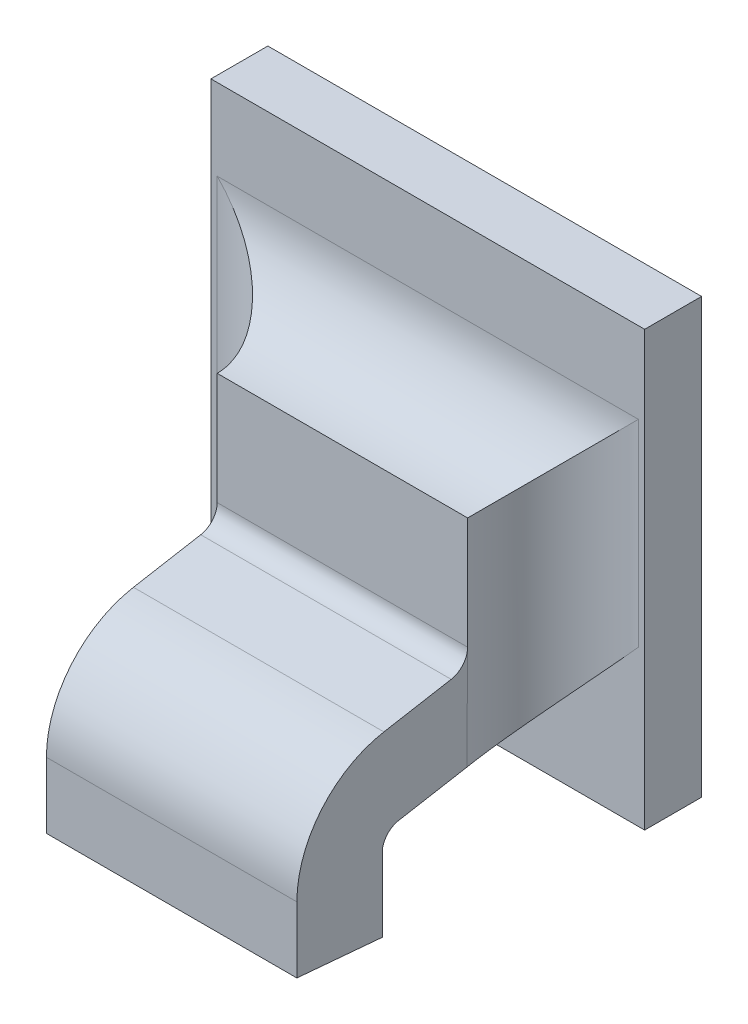
ISO-10303-21;
HEADER;
FILE_DESCRIPTION(('STEP AP214'),'2;1');
FILE_NAME('part.step','',(''),(''),'','','');
FILE_SCHEMA(('AUTOMOTIVE_DESIGN { 1 0 10303 214 1 1 1 1 }'));
ENDSEC;
DATA;
#1=APPLICATION_CONTEXT('core data for automotive mechanical design processes');
#2=APPLICATION_PROTOCOL_DEFINITION('international standard','automotive_design',2000,#1);
#3=PRODUCT_CONTEXT('',#1,'mechanical');
#4=PRODUCT('Part','Part','',(#3));
#5=PRODUCT_RELATED_PRODUCT_CATEGORY('part','',(#4));
#6=PRODUCT_DEFINITION_FORMATION('','',#4);
#7=PRODUCT_DEFINITION_CONTEXT('part definition',#1,'design');
#8=PRODUCT_DEFINITION('design','',#6,#7);
#9=PRODUCT_DEFINITION_SHAPE('','',#8);
#10=(LENGTH_UNIT() NAMED_UNIT(*) SI_UNIT(.MILLI.,.METRE.));
#11=(NAMED_UNIT(*) PLANE_ANGLE_UNIT() SI_UNIT($,.RADIAN.));
#12=(NAMED_UNIT(*) SI_UNIT($,.STERADIAN.) SOLID_ANGLE_UNIT());
#13=UNCERTAINTY_MEASURE_WITH_UNIT(LENGTH_MEASURE(1.E-05),#10,'distance_accuracy_value','');
#14=(GEOMETRIC_REPRESENTATION_CONTEXT(3) GLOBAL_UNCERTAINTY_ASSIGNED_CONTEXT((#13)) GLOBAL_UNIT_ASSIGNED_CONTEXT((#10,
#11,#12)) REPRESENTATION_CONTEXT('',''));
#15=CARTESIAN_POINT('',(0.,0.,0.));
#16=DIRECTION('',(0.,0.,1.));
#17=DIRECTION('',(1.,0.,0.));
#18=AXIS2_PLACEMENT_3D('',#15,#16,#17);
#19=CARTESIAN_POINT('',(-1.25044320945337,-0.409030625475599,0.0757120583538573));
#20=DIRECTION('',(0.,0.984807753012208,0.17364817766693));
#21=DIRECTION('',(0.,-0.17364817766693,0.984807753012208));
#22=AXIS2_PLACEMENT_3D('',#19,#20,#21);
#23=PLANE('',#22);
#24=DIRECTION('',(0.,-0.1736481776669,0.984807753012213));
#25=VECTOR('',#24,1.);
#26=CARTESIAN_POINT('',(-1.23225423307541,-0.40907165363979,0.0759447406355241));
#27=LINE('',#26,#25);
#28=CARTESIAN_POINT('',(-1.23225423307541,-0.40907165363979,0.0759447406355241));
#29=VERTEX_POINT('',#28);
#30=CARTESIAN_POINT('',(-1.23225423307541,-0.409892216923603,0.0805983862688596));
#31=VERTEX_POINT('',#30);
#32=EDGE_CURVE('E149',#29,#31,#27,.T.);
#33=ORIENTED_EDGE('',*,*,#32,.F.);
#34=DIRECTION('',(1.,0.,0.));
#35=VECTOR('',#34,1.);
#36=CARTESIAN_POINT('',(-1.23138809134313,-0.409071653639789,0.0759447406355242));
#37=LINE('',#36,#35);
#38=CARTESIAN_POINT('',(-1.24957706772108,-0.40907165363979,0.0759447406355241));
#39=VERTEX_POINT('',#38);
#40=EDGE_CURVE('E145',#29,#39,#37,.F.);
#41=ORIENTED_EDGE('',*,*,#40,.T.);
#42=DIRECTION('',(0.,-0.1736481776669,0.984807753012213));
#43=VECTOR('',#42,1.);
#44=CARTESIAN_POINT('',(-1.24957706772108,-0.40907165363979,0.0759447406355241));
#45=LINE('',#44,#43);
#46=CARTESIAN_POINT('',(-1.24957706772108,-0.409892216923603,0.0805983862688596));
#47=VERTEX_POINT('',#46);
#48=EDGE_CURVE('E187',#39,#47,#45,.T.);
#49=ORIENTED_EDGE('',*,*,#48,.T.);
#50=DIRECTION('',(1.,0.,0.));
#51=VECTOR('',#50,1.);
#52=CARTESIAN_POINT('',(-1.23138809134313,-0.409892216923603,0.0805983862688598));
#53=LINE('',#52,#51);
#54=EDGE_CURVE('E228',#31,#47,#53,.F.);
#55=ORIENTED_EDGE('',*,*,#54,.F.);
#56=EDGE_LOOP('',(#33,#41,#49,#55));
#57=FACE_BOUND('',#56,.T.);
#58=ADVANCED_FACE('F17',(#57),#23,.T.);
#59=CARTESIAN_POINT('',(-1.23138809134313,-0.417065029297904,0.0793336259197108));
#60=DIRECTION('',(1.,0.,0.));
#61=DIRECTION('',(0.,1.,0.));
#62=AXIS2_PLACEMENT_3D('',#59,#60,#61);
#63=CYLINDRICAL_SURFACE('',#62,0.00728346456692914);
#64=CARTESIAN_POINT('',(-1.23225423307541,-0.417065029297904,0.0793336259197108));
#65=DIRECTION('',(1.,0.,0.));
#66=DIRECTION('',(0.,1.,0.));
#67=AXIS2_PLACEMENT_3D('',#64,#65,#66);
#68=CIRCLE('',#67,0.00728346456692914);
#69=CARTESIAN_POINT('',(-1.23225423307541,-0.417065029297904,0.0866170904866399));
#70=VERTEX_POINT('',#69);
#71=EDGE_CURVE('E202',#31,#70,#68,.T.);
#72=ORIENTED_EDGE('',*,*,#71,.F.);
#73=ORIENTED_EDGE('',*,*,#54,.T.);
#74=CARTESIAN_POINT('',(-1.24957706772108,-0.417065029297904,0.0793336259197108));
#75=DIRECTION('',(1.,0.,0.));
#76=DIRECTION('',(0.,1.,0.));
#77=AXIS2_PLACEMENT_3D('',#74,#75,#76);
#78=CIRCLE('',#77,0.00728346456692914);
#79=CARTESIAN_POINT('',(-1.24957706772108,-0.417065029297904,0.0866170904866399));
#80=VERTEX_POINT('',#79);
#81=EDGE_CURVE('E184',#47,#80,#78,.T.);
#82=ORIENTED_EDGE('',*,*,#81,.T.);
#83=DIRECTION('',(1.,0.,0.));
#84=VECTOR('',#83,1.);
#85=CARTESIAN_POINT('',(-1.25044320945337,-0.417065029297904,0.0866170904866399));
#86=LINE('',#85,#84);
#87=EDGE_CURVE('E224',#70,#80,#86,.F.);
#88=ORIENTED_EDGE('',*,*,#87,.F.);
#89=EDGE_LOOP('',(#72,#73,#82,#88));
#90=FACE_BOUND('',#89,.T.);
#91=ADVANCED_FACE('F278',(#90),#63,.T.);
#92=CARTESIAN_POINT('',(-1.25044320945337,-0.416837019770818,0.0866170904866399));
#93=DIRECTION('',(0.,0.,1.));
#94=DIRECTION('',(0.,-1.,0.));
#95=AXIS2_PLACEMENT_3D('',#92,#93,#94);
#96=PLANE('',#95);
#97=ORIENTED_EDGE('',*,*,#87,.T.);
#98=DIRECTION('',(0.,1.,0.));
#99=VECTOR('',#98,1.);
#100=CARTESIAN_POINT('',(-1.24957706772108,-0.422863247680058,0.0866170904866399));
#101=LINE('',#100,#99);
#102=CARTESIAN_POINT('',(-1.24957706772108,-0.421625219839629,0.0866170904866399));
#103=VERTEX_POINT('',#102);
#104=EDGE_CURVE('E181',#80,#103,#101,.F.);
#105=ORIENTED_EDGE('',*,*,#104,.T.);
#106=DIRECTION('',(1.,0.,0.));
#107=VECTOR('',#106,1.);
#108=CARTESIAN_POINT('',(-1.24091565039825,-0.421625219839629,0.0866170904866399));
#109=LINE('',#108,#107);
#110=CARTESIAN_POINT('',(-1.23225423307541,-0.421625219839629,0.0866170904866399));
#111=VERTEX_POINT('',#110);
#112=EDGE_CURVE('E215',#103,#111,#109,.T.);
#113=ORIENTED_EDGE('',*,*,#112,.T.);
#114=DIRECTION('',(0.,1.,0.));
#115=VECTOR('',#114,1.);
#116=CARTESIAN_POINT('',(-1.23225423307541,-0.422863247680058,0.0866170904866399));
#117=LINE('',#116,#115);
#118=EDGE_CURVE('E200',#70,#111,#117,.F.);
#119=ORIENTED_EDGE('',*,*,#118,.F.);
#120=EDGE_LOOP('',(#97,#105,#113,#119));
#121=FACE_BOUND('',#120,.T.);
#122=ADVANCED_FACE('F282',(#121),#96,.T.);
#123=CARTESIAN_POINT('',(-1.24091565039825,-0.421657307598093,0.0862503257291207));
#124=DIRECTION('',(0.,0.99619469809174,-0.0871557427477276));
#125=DIRECTION('',(0.,0.0871557427477276,0.99619469809174));
#126=AXIS2_PLACEMENT_3D('',#123,#124,#125);
#127=PLANE('',#126);
#128=DIRECTION('',(0.,-0.0871557427476629,-0.996194698091745));
#129=VECTOR('',#128,1.);
#130=CARTESIAN_POINT('',(-1.23225423307541,-0.421625219839629,0.0866170904866399));
#131=LINE('',#130,#129);
#132=CARTESIAN_POINT('',(-1.23225423307541,-0.422141885175412,0.0807115786756163));
#133=VERTEX_POINT('',#132);
#134=EDGE_CURVE('E197',#111,#133,#131,.T.);
#135=ORIENTED_EDGE('',*,*,#134,.F.);
#136=ORIENTED_EDGE('',*,*,#112,.F.);
#137=DIRECTION('',(0.,-0.0871557427476629,-0.996194698091745));
#138=VECTOR('',#137,1.);
#139=CARTESIAN_POINT('',(-1.24957706772108,-0.421625219839629,0.0866170904866399));
#140=LINE('',#139,#138);
#141=CARTESIAN_POINT('',(-1.24957706772108,-0.422141885175412,0.0807115786756163));
#142=VERTEX_POINT('',#141);
#143=EDGE_CURVE('E178',#103,#142,#140,.T.);
#144=ORIENTED_EDGE('',*,*,#143,.T.);
#145=DIRECTION('',(1.,0.,0.));
#146=VECTOR('',#145,1.);
#147=CARTESIAN_POINT('',(-1.25044320945337,-0.422141885175412,0.0807115786756163));
#148=LINE('',#147,#146);
#149=EDGE_CURVE('E212',#142,#133,#148,.T.);
#150=ORIENTED_EDGE('',*,*,#149,.T.);
#151=EDGE_LOOP('',(#135,#136,#144,#150));
#152=FACE_BOUND('',#151,.T.);
#153=ADVANCED_FACE('F286',(#152),#127,.F.);
#154=CARTESIAN_POINT('',(-1.25044320945337,-0.416811186504029,0.0807115786756163));
#155=DIRECTION('',(0.,0.,1.));
#156=DIRECTION('',(0.,-1.,0.));
#157=AXIS2_PLACEMENT_3D('',#154,#155,#156);
#158=PLANE('',#157);
#159=ORIENTED_EDGE('',*,*,#149,.F.);
#160=DIRECTION('',(0.,1.,0.));
#161=VECTOR('',#160,1.);
#162=CARTESIAN_POINT('',(-1.24957706772108,-0.422863247680058,0.0807115786756163));
#163=LINE('',#162,#161);
#164=CARTESIAN_POINT('',(-1.24957706772108,-0.417065029297904,0.0807115786756163));
#165=VERTEX_POINT('',#164);
#166=EDGE_CURVE('E175',#142,#165,#163,.T.);
#167=ORIENTED_EDGE('',*,*,#166,.T.);
#168=DIRECTION('',(1.,0.,0.));
#169=VECTOR('',#168,1.);
#170=CARTESIAN_POINT('',(-1.23138809134313,-0.417065029297904,0.0807115786756163));
#171=LINE('',#170,#169);
#172=CARTESIAN_POINT('',(-1.23225423307541,-0.417065029297904,0.0807115786756163));
#173=VERTEX_POINT('',#172);
#174=EDGE_CURVE('E207',#165,#173,#171,.T.);
#175=ORIENTED_EDGE('',*,*,#174,.T.);
#176=DIRECTION('',(0.,1.,0.));
#177=VECTOR('',#176,1.);
#178=CARTESIAN_POINT('',(-1.23225423307541,-0.422863247680058,0.0807115786756163));
#179=LINE('',#178,#177);
#180=EDGE_CURVE('E194',#133,#173,#179,.T.);
#181=ORIENTED_EDGE('',*,*,#180,.F.);
#182=EDGE_LOOP('',(#159,#167,#175,#181));
#183=FACE_BOUND('',#182,.T.);
#184=ADVANCED_FACE('F290',(#183),#158,.F.);
#185=CARTESIAN_POINT('',(-1.23138809134313,-0.417065029297904,0.0793336259197108));
#186=DIRECTION('',(1.,0.,0.));
#187=DIRECTION('',(0.,1.,0.));
#188=AXIS2_PLACEMENT_3D('',#185,#186,#187);
#189=CYLINDRICAL_SURFACE('',#188,0.00137795275590551);
#190=DIRECTION('',(1.,0.,0.));
#191=VECTOR('',#190,1.);
#192=CARTESIAN_POINT('',(-1.25044320945337,-0.415708010740604,0.0795729049046849));
#193=LINE('',#192,#191);
#194=CARTESIAN_POINT('',(-1.24957706772108,-0.415708010740604,0.0795729049046849));
#195=VERTEX_POINT('',#194);
#196=CARTESIAN_POINT('',(-1.23225423307541,-0.415708010740604,0.0795729049046849));
#197=VERTEX_POINT('',#196);
#198=EDGE_CURVE('E191',#195,#197,#193,.T.);
#199=ORIENTED_EDGE('',*,*,#198,.T.);
#200=CARTESIAN_POINT('',(-1.23225423307541,-0.417065029297904,0.0793336259197108));
#201=DIRECTION('',(1.,0.,0.));
#202=DIRECTION('',(0.,1.,0.));
#203=AXIS2_PLACEMENT_3D('',#200,#201,#202);
#204=CIRCLE('',#203,0.00137795275590551);
#205=EDGE_CURVE('E196',#173,#197,#204,.F.);
#206=ORIENTED_EDGE('',*,*,#205,.F.);
#207=ORIENTED_EDGE('',*,*,#174,.F.);
#208=CARTESIAN_POINT('',(-1.24957706772108,-0.417065029297904,0.0793336259197108));
#209=DIRECTION('',(1.,0.,0.));
#210=DIRECTION('',(0.,1.,0.));
#211=AXIS2_PLACEMENT_3D('',#208,#209,#210);
#212=CIRCLE('',#211,0.00137795275590551);
#213=EDGE_CURVE('E172',#165,#195,#212,.F.);
#214=ORIENTED_EDGE('',*,*,#213,.T.);
#215=EDGE_LOOP('',(#199,#206,#207,#214));
#216=FACE_BOUND('',#215,.T.);
#217=ADVANCED_FACE('F294',(#216),#189,.F.);
#218=CARTESIAN_POINT('',(-1.23138809134313,-0.407714635082489,0.0761840196204982));
#219=DIRECTION('',(1.,0.,0.));
#220=DIRECTION('',(0.,1.,0.));
#221=AXIS2_PLACEMENT_3D('',#218,#219,#220);
#222=CYLINDRICAL_SURFACE('',#221,0.00137795275590552);
#223=ORIENTED_EDGE('',*,*,#40,.F.);
#224=CARTESIAN_POINT('',(-1.23225423307541,-0.407714635082489,0.0761840196204982));
#225=DIRECTION('',(1.,0.,0.));
#226=DIRECTION('',(0.,1.,0.));
#227=AXIS2_PLACEMENT_3D('',#224,#225,#226);
#228=CIRCLE('',#227,0.00137795275590552);
#229=CARTESIAN_POINT('',(-1.23225423307541,-0.407714635082489,0.0748060668645927));
#230=VERTEX_POINT('',#229);
#231=EDGE_CURVE('E20',#230,#29,#228,.F.);
#232=ORIENTED_EDGE('',*,*,#231,.F.);
#233=DIRECTION('',(1.,0.,0.));
#234=VECTOR('',#233,1.);
#235=CARTESIAN_POINT('',(-1.25044320945337,-0.407714635082489,0.0748060668645927));
#236=LINE('',#235,#234);
#237=CARTESIAN_POINT('',(-1.24957706772108,-0.407714635082489,0.0748060668645927));
#238=VERTEX_POINT('',#237);
#239=EDGE_CURVE('E127',#238,#230,#236,.T.);
#240=ORIENTED_EDGE('',*,*,#239,.F.);
#241=CARTESIAN_POINT('',(-1.24957706772108,-0.407714635082489,0.0761840196204982));
#242=DIRECTION('',(1.,0.,0.));
#243=DIRECTION('',(0.,1.,0.));
#244=AXIS2_PLACEMENT_3D('',#241,#242,#243);
#245=CIRCLE('',#244,0.00137795275590552);
#246=EDGE_CURVE('E139',#238,#39,#245,.F.);
#247=ORIENTED_EDGE('',*,*,#246,.T.);
#248=EDGE_LOOP('',(#223,#232,#240,#247));
#249=FACE_BOUND('',#248,.T.);
#250=ADVANCED_FACE('F143',(#249),#222,.F.);
#251=CARTESIAN_POINT('',(-1.23225423307541,-0.422863247680058,0.0742155156834903));
#252=DIRECTION('',(1.,0.,0.));
#253=DIRECTION('',(0.,1.,0.));
#254=AXIS2_PLACEMENT_3D('',#251,#252,#253);
#255=PLANE('',#254);
#256=ORIENTED_EDGE('',*,*,#205,.T.);
#257=DIRECTION('',(0.,-0.17364817766693,0.984807753012208));
#258=VECTOR('',#257,1.);
#259=CARTESIAN_POINT('',(-1.23225423307541,-0.4148464192926,0.0746865769896825));
#260=LINE('',#259,#258);
#261=CARTESIAN_POINT('',(-1.23225423307541,-0.414877006254794,0.074862663067971));
#262=VERTEX_POINT('',#261);
#263=EDGE_CURVE('E162',#197,#262,#260,.F.);
#264=ORIENTED_EDGE('',*,*,#263,.T.);
#265=DIRECTION('',(0.,1.,0.));
#266=VECTOR('',#265,1.);
#267=CARTESIAN_POINT('',(-1.23225423307541,-0.393026144704955,0.0748060668645927));
#268=LINE('',#267,#266);
#269=EDGE_CURVE('E138',#262,#230,#268,.T.);
#270=ORIENTED_EDGE('',*,*,#269,.T.);
#271=ORIENTED_EDGE('',*,*,#231,.T.);
#272=ORIENTED_EDGE('',*,*,#32,.T.);
#273=ORIENTED_EDGE('',*,*,#71,.T.);
#274=ORIENTED_EDGE('',*,*,#118,.T.);
#275=ORIENTED_EDGE('',*,*,#134,.T.);
#276=ORIENTED_EDGE('',*,*,#180,.T.);
#277=EDGE_LOOP('',(#256,#264,#270,#271,#272,#273,#274,#275,#276));
#278=FACE_BOUND('',#277,.T.);
#279=ADVANCED_FACE('F160',(#278),#255,.T.);
#280=CARTESIAN_POINT('',(-1.25044320945337,-0.4148464192926,0.0746865769896825));
#281=DIRECTION('',(0.,0.984807753012208,0.17364817766693));
#282=DIRECTION('',(0.,-0.17364817766693,0.984807753012208));
#283=AXIS2_PLACEMENT_3D('',#280,#281,#282);
#284=PLANE('',#283);
#285=DIRECTION('',(1.,0.,0.));
#286=VECTOR('',#285,1.);
#287=CARTESIAN_POINT('',(-1.224892028351,-0.414887447456791,0.0749192592713494));
#288=LINE('',#287,#286);
#289=CARTESIAN_POINT('',(-1.24957706772108,-0.414877006254794,0.074862663067971));
#290=VERTEX_POINT('',#289);
#291=EDGE_CURVE('E243',#262,#290,#288,.F.);
#292=ORIENTED_EDGE('',*,*,#291,.F.);
#293=ORIENTED_EDGE('',*,*,#263,.F.);
#294=ORIENTED_EDGE('',*,*,#198,.F.);
#295=DIRECTION('',(0.,0.173648177666878,-0.984807753012217));
#296=VECTOR('',#295,1.);
#297=CARTESIAN_POINT('',(-1.24957706772108,-0.415708010740604,0.0795729049046849));
#298=LINE('',#297,#296);
#299=EDGE_CURVE('E169',#195,#290,#298,.T.);
#300=ORIENTED_EDGE('',*,*,#299,.T.);
#301=EDGE_LOOP('',(#292,#293,#294,#300));
#302=FACE_BOUND('',#301,.T.);
#303=ADVANCED_FACE('F297',(#302),#284,.F.);
#304=CARTESIAN_POINT('',(-1.24957706772108,-0.422863247680058,0.0742155156834903));
#305=DIRECTION('',(1.,0.,0.));
#306=DIRECTION('',(0.,1.,0.));
#307=AXIS2_PLACEMENT_3D('',#304,#305,#306);
#308=PLANE('',#307);
#309=DIRECTION('',(0.,-1.,0.));
#310=VECTOR('',#309,1.);
#311=CARTESIAN_POINT('',(-1.24957706772109,-0.449184274957739,0.0748060668645927));
#312=LINE('',#311,#310);
#313=EDGE_CURVE('E239',#238,#290,#312,.T.);
#314=ORIENTED_EDGE('',*,*,#313,.T.);
#315=ORIENTED_EDGE('',*,*,#299,.F.);
#316=ORIENTED_EDGE('',*,*,#213,.F.);
#317=ORIENTED_EDGE('',*,*,#166,.F.);
#318=ORIENTED_EDGE('',*,*,#143,.F.);
#319=ORIENTED_EDGE('',*,*,#104,.F.);
#320=ORIENTED_EDGE('',*,*,#81,.F.);
#321=ORIENTED_EDGE('',*,*,#48,.F.);
#322=ORIENTED_EDGE('',*,*,#246,.F.);
#323=EDGE_LOOP('',(#314,#315,#316,#317,#318,#319,#320,#321,#322));
#324=FACE_BOUND('',#323,.T.);
#325=ADVANCED_FACE('F300',(#324),#308,.F.);
#326=CARTESIAN_POINT('',(-1.25044320945337,-0.399584528605045,0.0748060668645927));
#327=DIRECTION('',(0.,0.,1.));
#328=DIRECTION('',(0.,-1.,0.));
#329=AXIS2_PLACEMENT_3D('',#326,#327,#328);
#330=PLANE('',#329);
#331=DIRECTION('',(0.,1.,0.));
#332=VECTOR('',#331,1.);
#333=CARTESIAN_POINT('',(-1.23225423307541,-0.393026144704955,0.0748060668645927));
#334=LINE('',#333,#332);
#335=CARTESIAN_POINT('',(-1.23225423307541,-0.399971676532543,0.0748060668645927));
#336=VERTEX_POINT('',#335);
#337=EDGE_CURVE('E132',#230,#336,#334,.T.);
#338=ORIENTED_EDGE('',*,*,#337,.T.);
#339=DIRECTION('',(-1.,0.,0.));
#340=VECTOR('',#339,1.);
#341=CARTESIAN_POINT('',(-1.25693927244549,-0.399971676532543,0.0748060668645927));
#342=LINE('',#341,#340);
#343=CARTESIAN_POINT('',(-1.24957706772109,-0.399971676532543,0.0748060668645927));
#344=VERTEX_POINT('',#343);
#345=EDGE_CURVE('E237',#336,#344,#342,.T.);
#346=ORIENTED_EDGE('',*,*,#345,.T.);
#347=DIRECTION('',(0.,-1.,0.));
#348=VECTOR('',#347,1.);
#349=CARTESIAN_POINT('',(-1.24957706772109,-0.449184274957739,0.0748060668645927));
#350=LINE('',#349,#348);
#351=EDGE_CURVE('E134',#344,#238,#350,.T.);
#352=ORIENTED_EDGE('',*,*,#351,.T.);
#353=ORIENTED_EDGE('',*,*,#239,.T.);
#354=EDGE_LOOP('',(#338,#346,#352,#353));
#355=FACE_BOUND('',#354,.T.);
#356=ADVANCED_FACE('F129',(#355),#330,.T.);
#357=CARTESIAN_POINT('',(-1.22634872126439,-0.393026144704955,0.0748060668645927));
#358=DIRECTION('',(0.,1.,0.));
#359=DIRECTION('',(-1.,0.,0.));
#360=AXIS2_PLACEMENT_3D('',#357,#358,#359);
#361=CYLINDRICAL_SURFACE('',#360,0.00590551181102362);
#362=DIRECTION('',(0.,-1.,0.));
#363=VECTOR('',#362,1.);
#364=CARTESIAN_POINT('',(-1.22634872126439,-0.386955627617741,0.068900555053569));
#365=LINE('',#364,#363);
#366=CARTESIAN_POINT('',(-1.22634872126439,-0.394066164721519,0.068900555053569));
#367=VERTEX_POINT('',#366);
#368=CARTESIAN_POINT('',(-1.22634872126439,-0.407714635082489,0.068900555053569));
#369=VERTEX_POINT('',#368);
#370=EDGE_CURVE('E236',#367,#369,#365,.T.);
#371=ORIENTED_EDGE('',*,*,#370,.F.);
#372=CARTESIAN_POINT('',(-1.22634872126439,-0.394066164721519,0.0748060668645927));
#373=DIRECTION('',(-0.707106781186547,0.707106781186548,0.));
#374=DIRECTION('',(0.707106781186548,0.707106781186547,0.));
#375=AXIS2_PLACEMENT_3D('',#372,#373,#374);
#376=ELLIPSE('',#375,0.0083516548959041,0.00590551181102362);
#377=EDGE_CURVE('E156',#367,#336,#376,.T.);
#378=ORIENTED_EDGE('',*,*,#377,.T.);
#379=ORIENTED_EDGE('',*,*,#337,.F.);
#380=ORIENTED_EDGE('',*,*,#269,.F.);
#381=CARTESIAN_POINT('',(-1.23225396229641,-0.414877229399998,0.0748626193057814));
#382=CARTESIAN_POINT('',(-1.23225718309531,-0.414822345358043,0.0745625907676648));
#383=CARTESIAN_POINT('',(-1.23223684497601,-0.414747912523892,0.0742670861215288));
#384=CARTESIAN_POINT('',(-1.23215581236243,-0.414566029192177,0.0736951202756243));
#385=CARTESIAN_POINT('',(-1.23209549587134,-0.414458892981912,0.0734185072209176));
#386=CARTESIAN_POINT('',(-1.23194141149488,-0.414216970584898,0.0728895664132635));
#387=CARTESIAN_POINT('',(-1.23184778476588,-0.414082302078734,0.0726371418024798));
#388=CARTESIAN_POINT('',(-1.2316335371719,-0.413790403393458,0.0721575004164845));
#389=CARTESIAN_POINT('',(-1.2315128474121,-0.413633116006272,0.0719303502308829));
#390=CARTESIAN_POINT('',(-1.23118249870071,-0.413215165967727,0.0713921813150783));
#391=CARTESIAN_POINT('',(-1.23095908812016,-0.41294307698677,0.0710984599177276));
#392=CARTESIAN_POINT('',(-1.23047931096424,-0.412371662479598,0.0705703773106214));
#393=CARTESIAN_POINT('',(-1.23022286830457,-0.412072274554655,0.0703361569747717));
#394=CARTESIAN_POINT('',(-1.22958736144614,-0.41133940549552,0.0698459866782061));
#395=CARTESIAN_POINT('',(-1.22919844120996,-0.410897824870701,0.0696149681298131));
#396=CARTESIAN_POINT('',(-1.22839846690596,-0.409996799769943,0.0692502815851391));
#397=CARTESIAN_POINT('',(-1.22798742834009,-0.409537367866513,0.0691165463367526));
#398=CARTESIAN_POINT('',(-1.22728604448926,-0.408755994596217,0.0689681308468836));
#399=CARTESIAN_POINT('',(-1.22699827109517,-0.408436116517512,0.0689292677247087));
#400=CARTESIAN_POINT('',(-1.22658956187027,-0.407982102078162,0.0689042416244373));
#401=CARTESIAN_POINT('',(-1.22646913425858,-0.407848360835383,0.0689005652100869));
#402=CARTESIAN_POINT('',(-1.22634872126439,-0.407714635082489,0.0689005550535691));
#403=B_SPLINE_CURVE_WITH_KNOTS('',3,(#381,#382,#383,#384,#385,#386,#387,#388,#389,#390,#391,
#392,#393,#394,#395,#396,#397,#398,#399,#400,#401,#402),.UNSPECIFIED.,.F.,.F.,(4,2,2,2,2,2,2,2,
2,2,4),(0.,0.000911854640629308,0.00181520821824949,0.00271477844400076,0.00361666525652745,
0.00498448467542,0.00635551296143178,0.00824194679715802,0.0101270752955221,0.0114210586750925,
0.0119609297477214),.UNSPECIFIED.);
#404=EDGE_CURVE('E157',#369,#262,#403,.F.);
#405=ORIENTED_EDGE('',*,*,#404,.F.);
#406=EDGE_LOOP('',(#371,#378,#379,#380,#405));
#407=FACE_BOUND('',#406,.T.);
#408=ADVANCED_FACE('F153',(#407),#361,.F.);
#409=CARTESIAN_POINT('',(-1.224892028351,-0.407714635082489,0.0761840196204982));
#410=DIRECTION('',(1.,0.,0.));
#411=DIRECTION('',(0.,1.,0.));
#412=AXIS2_PLACEMENT_3D('',#409,#410,#411);
#413=CYLINDRICAL_SURFACE('',#412,0.00728346456692914);
#414=ORIENTED_EDGE('',*,*,#404,.T.);
#415=ORIENTED_EDGE('',*,*,#291,.T.);
#416=CARTESIAN_POINT('',(-1.24957733850009,-0.414877229399998,0.0748626193057814));
#417=CARTESIAN_POINT('',(-1.24957411770119,-0.414822345358043,0.0745625907676648));
#418=CARTESIAN_POINT('',(-1.24959445582049,-0.414747912523892,0.0742670861215287));
#419=CARTESIAN_POINT('',(-1.24967548843407,-0.414566029192177,0.0736951202756243));
#420=CARTESIAN_POINT('',(-1.24973580492516,-0.414458892981912,0.0734185072209176));
#421=CARTESIAN_POINT('',(-1.24988988930162,-0.414216970584898,0.0728895664132635));
#422=CARTESIAN_POINT('',(-1.24998351603062,-0.414082302078734,0.0726371418024797));
#423=CARTESIAN_POINT('',(-1.2501977636246,-0.413790403393458,0.0721575004164845));
#424=CARTESIAN_POINT('',(-1.2503184533844,-0.413633116006272,0.0719303502308829));
#425=CARTESIAN_POINT('',(-1.25064880209579,-0.413215165967727,0.0713921813150784));
#426=CARTESIAN_POINT('',(-1.25087221267634,-0.41294307698677,0.0710984599177278));
#427=CARTESIAN_POINT('',(-1.25135198983226,-0.412371662479598,0.0705703773106216));
#428=CARTESIAN_POINT('',(-1.25160843249193,-0.412072274554655,0.0703361569747717));
#429=CARTESIAN_POINT('',(-1.25224393935036,-0.41133940549552,0.0698459866782061));
#430=CARTESIAN_POINT('',(-1.25263285958654,-0.410897824870701,0.0696149681298131));
#431=CARTESIAN_POINT('',(-1.25343283389054,-0.409996799769943,0.0692502815851391));
#432=CARTESIAN_POINT('',(-1.25384387245641,-0.409537367866513,0.0691165463367526));
#433=CARTESIAN_POINT('',(-1.25454525630724,-0.408755994596217,0.0689681308468836));
#434=CARTESIAN_POINT('',(-1.25483302970133,-0.408436116517513,0.0689292677247087));
#435=CARTESIAN_POINT('',(-1.25524173892623,-0.407982102078162,0.0689042416244373));
#436=CARTESIAN_POINT('',(-1.25536216653792,-0.407848360835383,0.0689005652100869));
#437=CARTESIAN_POINT('',(-1.25548257953211,-0.407714635082489,0.0689005550535691));
#438=B_SPLINE_CURVE_WITH_KNOTS('',3,(#416,#417,#418,#419,#420,#421,#422,#423,#424,#425,#426,
#427,#428,#429,#430,#431,#432,#433,#434,#435,#436,#437),.UNSPECIFIED.,.F.,.F.,(4,2,2,2,2,2,2,2,
2,2,4),(0.,0.000911854640629308,0.00181520821824948,0.00271477844400076,0.00361666525652743,
0.00498448467541956,0.00635551296143176,0.00824194679715809,0.0101270752955223,
0.0114210586750923,0.0119609297477214),.UNSPECIFIED.);
#439=CARTESIAN_POINT('',(-1.25548257953211,-0.407714635082489,0.068900555053569));
#440=VERTEX_POINT('',#439);
#441=EDGE_CURVE('E240',#290,#440,#438,.T.);
#442=ORIENTED_EDGE('',*,*,#441,.T.);
#443=DIRECTION('',(1.,0.,0.));
#444=VECTOR('',#443,1.);
#445=CARTESIAN_POINT('',(-1.25741565039825,-0.407714635082489,0.068900555053569));
#446=LINE('',#445,#444);
#447=EDGE_CURVE('E310',#369,#440,#446,.F.);
#448=ORIENTED_EDGE('',*,*,#447,.F.);
#449=EDGE_LOOP('',(#414,#415,#442,#448));
#450=FACE_BOUND('',#449,.T.);
#451=ADVANCED_FACE('F255',(#450),#413,.T.);
#452=CARTESIAN_POINT('',(-1.25548257953211,-0.449184274957739,0.0748060668645927));
#453=DIRECTION('',(0.,-1.,0.));
#454=DIRECTION('',(1.,0.,0.));
#455=AXIS2_PLACEMENT_3D('',#452,#453,#454);
#456=CYLINDRICAL_SURFACE('',#455,0.00590551181102362);
#457=ORIENTED_EDGE('',*,*,#351,.F.);
#458=CARTESIAN_POINT('',(-1.25548257953211,-0.394066164721519,0.0748060668645927));
#459=DIRECTION('',(-0.707106781186548,-0.707106781186547,0.));
#460=DIRECTION('',(0.707106781186547,-0.707106781186548,0.));
#461=AXIS2_PLACEMENT_3D('',#458,#459,#460);
#462=ELLIPSE('',#461,0.0083516548959041,0.00590551181102362);
#463=CARTESIAN_POINT('',(-1.25548257953211,-0.394066164721519,0.068900555053569));
#464=VERTEX_POINT('',#463);
#465=EDGE_CURVE('E233',#344,#464,#462,.F.);
#466=ORIENTED_EDGE('',*,*,#465,.T.);
#467=DIRECTION('',(0.,-1.,0.));
#468=VECTOR('',#467,1.);
#469=CARTESIAN_POINT('',(-1.25548257953211,-0.386955627617741,0.068900555053569));
#470=LINE('',#469,#468);
#471=EDGE_CURVE('E312',#440,#464,#470,.F.);
#472=ORIENTED_EDGE('',*,*,#471,.F.);
#473=ORIENTED_EDGE('',*,*,#441,.F.);
#474=ORIENTED_EDGE('',*,*,#313,.F.);
#475=EDGE_LOOP('',(#457,#466,#472,#473,#474));
#476=FACE_BOUND('',#475,.T.);
#477=ADVANCED_FACE('F252',(#476),#456,.F.);
#478=CARTESIAN_POINT('',(-1.25693927244549,-0.394066164721519,0.0748060668645927));
#479=DIRECTION('',(-1.,0.,0.));
#480=DIRECTION('',(0.,-1.,0.));
#481=AXIS2_PLACEMENT_3D('',#478,#479,#480);
#482=CYLINDRICAL_SURFACE('',#481,0.00590551181102362);
#483=ORIENTED_EDGE('',*,*,#345,.F.);
#484=ORIENTED_EDGE('',*,*,#377,.F.);
#485=DIRECTION('',(1.,0.,0.));
#486=VECTOR('',#485,1.);
#487=CARTESIAN_POINT('',(-1.25741565039825,-0.394066164721519,0.068900555053569));
#488=LINE('',#487,#486);
#489=EDGE_CURVE('E320',#464,#367,#488,.T.);
#490=ORIENTED_EDGE('',*,*,#489,.F.);
#491=ORIENTED_EDGE('',*,*,#465,.F.);
#492=EDGE_LOOP('',(#483,#484,#490,#491));
#493=FACE_BOUND('',#492,.T.);
#494=ADVANCED_FACE('F382',(#493),#482,.F.);
#495=CARTESIAN_POINT('',(-1.25741565039825,-0.386955627617741,0.068900555053569));
#496=DIRECTION('',(0.,0.,1.));
#497=DIRECTION('',(0.,-1.,0.));
#498=AXIS2_PLACEMENT_3D('',#495,#496,#497);
#499=PLANE('',#498);
#500=ORIENTED_EDGE('',*,*,#471,.T.);
#501=ORIENTED_EDGE('',*,*,#489,.T.);
#502=ORIENTED_EDGE('',*,*,#370,.T.);
#503=ORIENTED_EDGE('',*,*,#447,.T.);
#504=EDGE_LOOP('',(#500,#501,#502,#503));
#505=FACE_BOUND('',#504,.T.);
#506=DIRECTION('',(0.,-1.,0.));
#507=VECTOR('',#506,1.);
#508=CARTESIAN_POINT('',(-1.22591565039825,-0.386955627617741,0.068900555053569));
#509=LINE('',#508,#507);
#510=CARTESIAN_POINT('',(-1.22591565039825,-0.418455627617741,0.068900555053569));
#511=VERTEX_POINT('',#510);
#512=CARTESIAN_POINT('',(-1.22591565039825,-0.388455627617741,0.068900555053569));
#513=VERTEX_POINT('',#512);
#514=EDGE_CURVE('E332',#511,#513,#509,.F.);
#515=ORIENTED_EDGE('',*,*,#514,.T.);
#516=DIRECTION('',(1.,0.,0.));
#517=VECTOR('',#516,1.);
#518=CARTESIAN_POINT('',(-1.25741565039825,-0.388455627617741,0.068900555053569));
#519=LINE('',#518,#517);
#520=CARTESIAN_POINT('',(-1.25591565039825,-0.388455627617741,0.068900555053569));
#521=VERTEX_POINT('',#520);
#522=EDGE_CURVE('E337',#513,#521,#519,.F.);
#523=ORIENTED_EDGE('',*,*,#522,.T.);
#524=DIRECTION('',(0.,1.,0.));
#525=VECTOR('',#524,1.);
#526=CARTESIAN_POINT('',(-1.25591565039825,-0.419955627617741,0.068900555053569));
#527=LINE('',#526,#525);
#528=CARTESIAN_POINT('',(-1.25591565039825,-0.418455627617741,0.068900555053569));
#529=VERTEX_POINT('',#528);
#530=EDGE_CURVE('E340',#521,#529,#527,.F.);
#531=ORIENTED_EDGE('',*,*,#530,.T.);
#532=DIRECTION('',(-1.,0.,0.));
#533=VECTOR('',#532,1.);
#534=CARTESIAN_POINT('',(-1.22441565039825,-0.418455627617741,0.068900555053569));
#535=LINE('',#534,#533);
#536=EDGE_CURVE('E324',#529,#511,#535,.F.);
#537=ORIENTED_EDGE('',*,*,#536,.T.);
#538=EDGE_LOOP('',(#515,#523,#531,#537));
#539=FACE_BOUND('',#538,.T.);
#540=ADVANCED_FACE('F317',(#505,#539),#499,.T.);
#541=CARTESIAN_POINT('',(-1.22441565039825,-0.418455627617741,0.0647666967858525));
#542=DIRECTION('',(0.,1.,0.));
#543=DIRECTION('',(-1.,0.,0.));
#544=AXIS2_PLACEMENT_3D('',#541,#542,#543);
#545=PLANE('',#544);
#546=DIRECTION('',(0.,0.,1.));
#547=VECTOR('',#546,1.);
#548=CARTESIAN_POINT('',(-1.22591565039825,-0.418455627617741,0.0647666967858525));
#549=LINE('',#548,#547);
#550=CARTESIAN_POINT('',(-1.22591565039825,-0.418455627617741,0.0649635471795533));
#551=VERTEX_POINT('',#550);
#552=EDGE_CURVE('E325',#551,#511,#549,.T.);
#553=ORIENTED_EDGE('',*,*,#552,.T.);
#554=ORIENTED_EDGE('',*,*,#536,.F.);
#555=DIRECTION('',(0.,0.,1.));
#556=VECTOR('',#555,1.);
#557=CARTESIAN_POINT('',(-1.25591565039825,-0.418455627617741,0.0647666967858525));
#558=LINE('',#557,#556);
#559=CARTESIAN_POINT('',(-1.25591565039825,-0.418455627617741,0.0649635471795533));
#560=VERTEX_POINT('',#559);
#561=EDGE_CURVE('E343',#529,#560,#558,.F.);
#562=ORIENTED_EDGE('',*,*,#561,.T.);
#563=DIRECTION('',(1.,0.,0.));
#564=VECTOR('',#563,1.);
#565=CARTESIAN_POINT('',(-1.25741565039825,-0.418455627617741,0.0649635471795533));
#566=LINE('',#565,#564);
#567=EDGE_CURVE('E346',#560,#551,#566,.T.);
#568=ORIENTED_EDGE('',*,*,#567,.T.);
#569=EDGE_LOOP('',(#553,#554,#562,#568));
#570=FACE_BOUND('',#569,.T.);
#571=ADVANCED_FACE('F364',(#570),#545,.F.);
#572=CARTESIAN_POINT('',(-1.22591565039825,-0.386955627617741,0.0647666967858525));
#573=DIRECTION('',(-1.,0.,0.));
#574=DIRECTION('',(0.,-1.,0.));
#575=AXIS2_PLACEMENT_3D('',#572,#573,#574);
#576=PLANE('',#575);
#577=DIRECTION('',(0.,0.,1.));
#578=VECTOR('',#577,1.);
#579=CARTESIAN_POINT('',(-1.22591565039825,-0.388455627617741,0.0647666967858525));
#580=LINE('',#579,#578);
#581=CARTESIAN_POINT('',(-1.22591565039825,-0.388455627617741,0.0649635471795533));
#582=VERTEX_POINT('',#581);
#583=EDGE_CURVE('E334',#582,#513,#580,.T.);
#584=ORIENTED_EDGE('',*,*,#583,.T.);
#585=ORIENTED_EDGE('',*,*,#514,.F.);
#586=ORIENTED_EDGE('',*,*,#552,.F.);
#587=DIRECTION('',(0.,-1.,0.));
#588=VECTOR('',#587,1.);
#589=CARTESIAN_POINT('',(-1.22591565039825,-0.386955627617741,0.0649635471795533));
#590=LINE('',#589,#588);
#591=EDGE_CURVE('E349',#551,#582,#590,.F.);
#592=ORIENTED_EDGE('',*,*,#591,.T.);
#593=EDGE_LOOP('',(#584,#585,#586,#592));
#594=FACE_BOUND('',#593,.T.);
#595=ADVANCED_FACE('F361',(#594),#576,.F.);
#596=CARTESIAN_POINT('',(-1.25741565039825,-0.388455627617741,0.0647666967858525));
#597=DIRECTION('',(0.,-1.,0.));
#598=DIRECTION('',(1.,0.,0.));
#599=AXIS2_PLACEMENT_3D('',#596,#597,#598);
#600=PLANE('',#599);
#601=DIRECTION('',(0.,0.,1.));
#602=VECTOR('',#601,1.);
#603=CARTESIAN_POINT('',(-1.25591565039825,-0.388455627617741,0.0647666967858525));
#604=LINE('',#603,#602);
#605=CARTESIAN_POINT('',(-1.25591565039825,-0.388455627617741,0.0649635471795533));
#606=VERTEX_POINT('',#605);
#607=EDGE_CURVE('E34',#606,#521,#604,.T.);
#608=ORIENTED_EDGE('',*,*,#607,.T.);
#609=ORIENTED_EDGE('',*,*,#522,.F.);
#610=ORIENTED_EDGE('',*,*,#583,.F.);
#611=DIRECTION('',(1.,0.,0.));
#612=VECTOR('',#611,1.);
#613=CARTESIAN_POINT('',(-1.25741565039825,-0.388455627617741,0.0649635471795533));
#614=LINE('',#613,#612);
#615=EDGE_CURVE('E26',#582,#606,#614,.F.);
#616=ORIENTED_EDGE('',*,*,#615,.T.);
#617=EDGE_LOOP('',(#608,#609,#610,#616));
#618=FACE_BOUND('',#617,.T.);
#619=ADVANCED_FACE('F355',(#618),#600,.F.);
#620=CARTESIAN_POINT('',(-1.25591565039825,-0.419955627617741,0.0647666967858525));
#621=DIRECTION('',(1.,0.,0.));
#622=DIRECTION('',(0.,1.,0.));
#623=AXIS2_PLACEMENT_3D('',#620,#621,#622);
#624=PLANE('',#623);
#625=ORIENTED_EDGE('',*,*,#561,.F.);
#626=ORIENTED_EDGE('',*,*,#530,.F.);
#627=ORIENTED_EDGE('',*,*,#607,.F.);
#628=DIRECTION('',(0.,-1.,0.));
#629=VECTOR('',#628,1.);
#630=CARTESIAN_POINT('',(-1.25591565039825,-0.386955627617741,0.0649635471795533));
#631=LINE('',#630,#629);
#632=EDGE_CURVE('E11',#606,#560,#631,.T.);
#633=ORIENTED_EDGE('',*,*,#632,.T.);
#634=EDGE_LOOP('',(#625,#626,#627,#633));
#635=FACE_BOUND('',#634,.T.);
#636=ADVANCED_FACE('F366',(#635),#624,.F.);
#637=CARTESIAN_POINT('',(-1.25741565039825,-0.386955627617741,0.0649635471795533));
#638=DIRECTION('',(0.,0.,1.));
#639=DIRECTION('',(0.,-1.,0.));
#640=AXIS2_PLACEMENT_3D('',#637,#638,#639);
#641=PLANE('',#640);
#642=ORIENTED_EDGE('',*,*,#615,.F.);
#643=ORIENTED_EDGE('',*,*,#591,.F.);
#644=ORIENTED_EDGE('',*,*,#567,.F.);
#645=ORIENTED_EDGE('',*,*,#632,.F.);
#646=EDGE_LOOP('',(#642,#643,#644,#645));
#647=FACE_BOUND('',#646,.T.);
#648=ADVANCED_FACE('F359',(#647),#641,.F.);
#649=CLOSED_SHELL('',(#58,#91,#122,#153,#184,#217,#250,#279,#303,#325,#356,#408,#451,#477,#494,
#540,#571,#595,#619,#636,#648));
#650=MANIFOLD_SOLID_BREP('B1',#649);
#651=ADVANCED_BREP_SHAPE_REPRESENTATION('',(#18,#650),#14);
#652=SHAPE_DEFINITION_REPRESENTATION(#9,#651);
ENDSEC;
END-ISO-10303-21;
